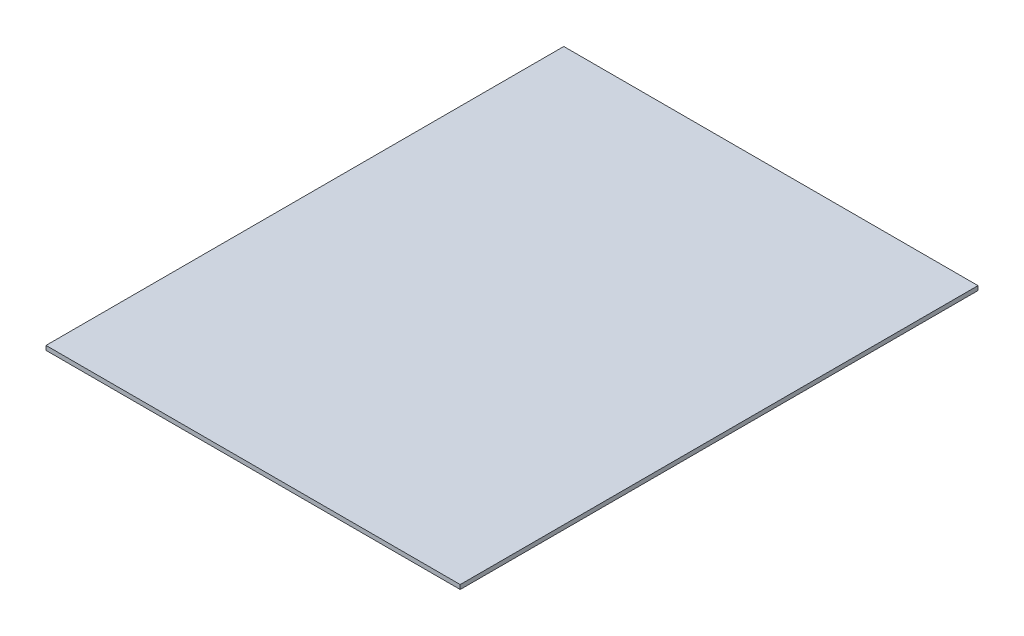
ISO-10303-21;
HEADER;
FILE_DESCRIPTION(('STEP AP214'),'2;1');
FILE_NAME('part.step','',(''),(''),'','','');
FILE_SCHEMA(('AUTOMOTIVE_DESIGN { 1 0 10303 214 1 1 1 1 }'));
ENDSEC;
DATA;
#1=APPLICATION_CONTEXT('core data for automotive mechanical design processes');
#2=APPLICATION_PROTOCOL_DEFINITION('international standard','automotive_design',2000,#1);
#3=PRODUCT_CONTEXT('',#1,'mechanical');
#4=PRODUCT('Part','Part','',(#3));
#5=PRODUCT_RELATED_PRODUCT_CATEGORY('part','',(#4));
#6=PRODUCT_DEFINITION_FORMATION('','',#4);
#7=PRODUCT_DEFINITION_CONTEXT('part definition',#1,'design');
#8=PRODUCT_DEFINITION('design','',#6,#7);
#9=PRODUCT_DEFINITION_SHAPE('','',#8);
#10=(LENGTH_UNIT() NAMED_UNIT(*) SI_UNIT(.MILLI.,.METRE.));
#11=(NAMED_UNIT(*) PLANE_ANGLE_UNIT() SI_UNIT($,.RADIAN.));
#12=(NAMED_UNIT(*) SI_UNIT($,.STERADIAN.) SOLID_ANGLE_UNIT());
#13=UNCERTAINTY_MEASURE_WITH_UNIT(LENGTH_MEASURE(1.E-05),#10,'distance_accuracy_value','');
#14=(GEOMETRIC_REPRESENTATION_CONTEXT(3) GLOBAL_UNCERTAINTY_ASSIGNED_CONTEXT((#13)) GLOBAL_UNIT_ASSIGNED_CONTEXT((#10,
#11,#12)) REPRESENTATION_CONTEXT('',''));
#15=CARTESIAN_POINT('',(0.,0.,0.));
#16=DIRECTION('',(0.,0.,1.));
#17=DIRECTION('',(1.,0.,0.));
#18=AXIS2_PLACEMENT_3D('',#15,#16,#17);
#19=CARTESIAN_POINT('',(0.,6.35,0.));
#20=DIRECTION('',(1.,0.,0.));
#21=DIRECTION('',(0.,0.,-1.));
#22=AXIS2_PLACEMENT_3D('',#19,#20,#21);
#23=PLANE('',#22);
#24=DIRECTION('',(0.,0.,1.));
#25=VECTOR('',#24,1.);
#26=CARTESIAN_POINT('',(0.,0.,0.));
#27=LINE('',#26,#25);
#28=CARTESIAN_POINT('',(0.,0.,-762.));
#29=VERTEX_POINT('',#28);
#30=CARTESIAN_POINT('',(0.,0.,0.));
#31=VERTEX_POINT('',#30);
#32=EDGE_CURVE('E97',#29,#31,#27,.T.);
#33=ORIENTED_EDGE('',*,*,#32,.T.);
#34=DIRECTION('',(0.,-1.,0.));
#35=VECTOR('',#34,1.);
#36=CARTESIAN_POINT('',(0.,6.35,0.));
#37=LINE('',#36,#35);
#38=CARTESIAN_POINT('',(0.,6.35,0.));
#39=VERTEX_POINT('',#38);
#40=EDGE_CURVE('E11',#39,#31,#37,.T.);
#41=ORIENTED_EDGE('',*,*,#40,.F.);
#42=DIRECTION('',(0.,0.,1.));
#43=VECTOR('',#42,1.);
#44=CARTESIAN_POINT('',(0.,6.35,0.));
#45=LINE('',#44,#43);
#46=CARTESIAN_POINT('',(0.,6.35,-762.));
#47=VERTEX_POINT('',#46);
#48=EDGE_CURVE('E85',#47,#39,#45,.T.);
#49=ORIENTED_EDGE('',*,*,#48,.F.);
#50=DIRECTION('',(0.,-1.,0.));
#51=VECTOR('',#50,1.);
#52=CARTESIAN_POINT('',(0.,6.35,-762.));
#53=LINE('',#52,#51);
#54=EDGE_CURVE('E93',#47,#29,#53,.T.);
#55=ORIENTED_EDGE('',*,*,#54,.T.);
#56=EDGE_LOOP('',(#33,#41,#49,#55));
#57=FACE_BOUND('',#56,.T.);
#58=ADVANCED_FACE('F34',(#57),#23,.F.);
#59=CARTESIAN_POINT('',(0.,6.35,0.));
#60=DIRECTION('',(0.,0.,-1.));
#61=DIRECTION('',(-1.,0.,0.));
#62=AXIS2_PLACEMENT_3D('',#59,#60,#61);
#63=PLANE('',#62);
#64=DIRECTION('',(1.,0.,0.));
#65=VECTOR('',#64,1.);
#66=CARTESIAN_POINT('',(0.,0.,0.));
#67=LINE('',#66,#65);
#68=CARTESIAN_POINT('',(609.6,0.,0.));
#69=VERTEX_POINT('',#68);
#70=EDGE_CURVE('E89',#31,#69,#67,.T.);
#71=ORIENTED_EDGE('',*,*,#70,.T.);
#72=DIRECTION('',(0.,-1.,0.));
#73=VECTOR('',#72,1.);
#74=CARTESIAN_POINT('',(609.6,6.35,0.));
#75=LINE('',#74,#73);
#76=CARTESIAN_POINT('',(609.6,6.35,0.));
#77=VERTEX_POINT('',#76);
#78=EDGE_CURVE('E42',#77,#69,#75,.T.);
#79=ORIENTED_EDGE('',*,*,#78,.F.);
#80=DIRECTION('',(1.,0.,0.));
#81=VECTOR('',#80,1.);
#82=CARTESIAN_POINT('',(0.,6.35,0.));
#83=LINE('',#82,#81);
#84=EDGE_CURVE('E80',#39,#77,#83,.T.);
#85=ORIENTED_EDGE('',*,*,#84,.F.);
#86=ORIENTED_EDGE('',*,*,#40,.T.);
#87=EDGE_LOOP('',(#71,#79,#85,#86));
#88=FACE_BOUND('',#87,.T.);
#89=ADVANCED_FACE('F88',(#88),#63,.F.);
#90=CARTESIAN_POINT('',(609.6,6.35,0.));
#91=DIRECTION('',(-1.,0.,0.));
#92=DIRECTION('',(0.,0.,1.));
#93=AXIS2_PLACEMENT_3D('',#90,#91,#92);
#94=PLANE('',#93);
#95=DIRECTION('',(0.,0.,-1.));
#96=VECTOR('',#95,1.);
#97=CARTESIAN_POINT('',(609.6,0.,0.));
#98=LINE('',#97,#96);
#99=CARTESIAN_POINT('',(609.6,0.,-762.));
#100=VERTEX_POINT('',#99);
#101=EDGE_CURVE('E67',#69,#100,#98,.T.);
#102=ORIENTED_EDGE('',*,*,#101,.T.);
#103=DIRECTION('',(0.,-1.,0.));
#104=VECTOR('',#103,1.);
#105=CARTESIAN_POINT('',(609.6,6.35,-762.));
#106=LINE('',#105,#104);
#107=CARTESIAN_POINT('',(609.6,6.35,-762.));
#108=VERTEX_POINT('',#107);
#109=EDGE_CURVE('E90',#108,#100,#106,.T.);
#110=ORIENTED_EDGE('',*,*,#109,.F.);
#111=DIRECTION('',(0.,0.,-1.));
#112=VECTOR('',#111,1.);
#113=CARTESIAN_POINT('',(609.6,6.35,0.));
#114=LINE('',#113,#112);
#115=EDGE_CURVE('E83',#77,#108,#114,.T.);
#116=ORIENTED_EDGE('',*,*,#115,.F.);
#117=ORIENTED_EDGE('',*,*,#78,.T.);
#118=EDGE_LOOP('',(#102,#110,#116,#117));
#119=FACE_BOUND('',#118,.T.);
#120=ADVANCED_FACE('F91',(#119),#94,.F.);
#121=CARTESIAN_POINT('',(0.,6.35,-762.));
#122=DIRECTION('',(0.,0.,1.));
#123=DIRECTION('',(1.,0.,0.));
#124=AXIS2_PLACEMENT_3D('',#121,#122,#123);
#125=PLANE('',#124);
#126=DIRECTION('',(-1.,0.,0.));
#127=VECTOR('',#126,1.);
#128=CARTESIAN_POINT('',(0.,0.,-762.));
#129=LINE('',#128,#127);
#130=EDGE_CURVE('E73',#100,#29,#129,.T.);
#131=ORIENTED_EDGE('',*,*,#130,.T.);
#132=ORIENTED_EDGE('',*,*,#54,.F.);
#133=DIRECTION('',(-1.,0.,0.));
#134=VECTOR('',#133,1.);
#135=CARTESIAN_POINT('',(0.,6.35,-762.));
#136=LINE('',#135,#134);
#137=EDGE_CURVE('E50',#108,#47,#136,.T.);
#138=ORIENTED_EDGE('',*,*,#137,.F.);
#139=ORIENTED_EDGE('',*,*,#109,.T.);
#140=EDGE_LOOP('',(#131,#132,#138,#139));
#141=FACE_BOUND('',#140,.T.);
#142=ADVANCED_FACE('F104',(#141),#125,.F.);
#143=CARTESIAN_POINT('',(0.,6.35,0.));
#144=DIRECTION('',(0.,-1.,0.));
#145=DIRECTION('',(0.,0.,-1.));
#146=AXIS2_PLACEMENT_3D('',#143,#144,#145);
#147=PLANE('',#146);
#148=ORIENTED_EDGE('',*,*,#48,.T.);
#149=ORIENTED_EDGE('',*,*,#84,.T.);
#150=ORIENTED_EDGE('',*,*,#115,.T.);
#151=ORIENTED_EDGE('',*,*,#137,.T.);
#152=EDGE_LOOP('',(#148,#149,#150,#151));
#153=FACE_BOUND('',#152,.T.);
#154=ADVANCED_FACE('F81',(#153),#147,.F.);
#155=CARTESIAN_POINT('',(0.,0.,0.));
#156=DIRECTION('',(0.,-1.,0.));
#157=DIRECTION('',(0.,0.,-1.));
#158=AXIS2_PLACEMENT_3D('',#155,#156,#157);
#159=PLANE('',#158);
#160=ORIENTED_EDGE('',*,*,#32,.F.);
#161=ORIENTED_EDGE('',*,*,#130,.F.);
#162=ORIENTED_EDGE('',*,*,#101,.F.);
#163=ORIENTED_EDGE('',*,*,#70,.F.);
#164=EDGE_LOOP('',(#160,#161,#162,#163));
#165=FACE_BOUND('',#164,.T.);
#166=ADVANCED_FACE('F107',(#165),#159,.T.);
#167=CLOSED_SHELL('',(#58,#89,#120,#142,#154,#166));
#168=MANIFOLD_SOLID_BREP('B2',#167);
#169=ADVANCED_BREP_SHAPE_REPRESENTATION('',(#18,#168),#14);
#170=SHAPE_DEFINITION_REPRESENTATION(#9,#169);
ENDSEC;
END-ISO-10303-21;
